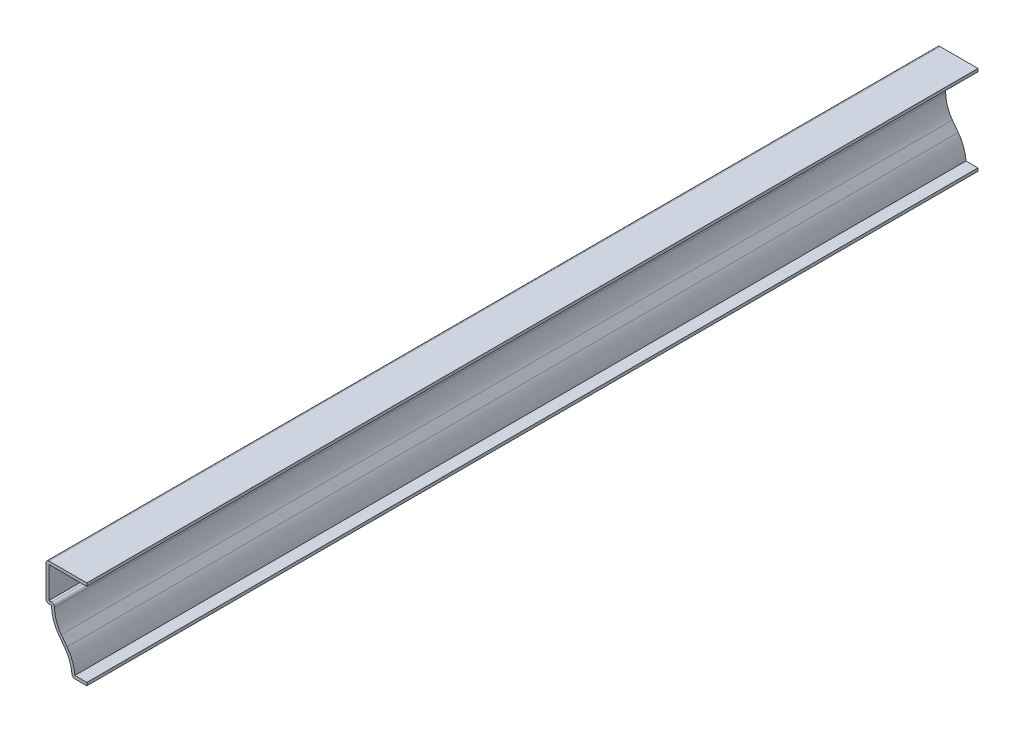
ISO-10303-21;
HEADER;
FILE_DESCRIPTION(('STEP AP214'),'2;1');
FILE_NAME('part.step','',(''),(''),'','','');
FILE_SCHEMA(('AUTOMOTIVE_DESIGN { 1 0 10303 214 1 1 1 1 }'));
ENDSEC;
DATA;
#1=APPLICATION_CONTEXT('core data for automotive mechanical design processes');
#2=APPLICATION_PROTOCOL_DEFINITION('international standard','automotive_design',2000,#1);
#3=PRODUCT_CONTEXT('',#1,'mechanical');
#4=PRODUCT('Part','Part','',(#3));
#5=PRODUCT_RELATED_PRODUCT_CATEGORY('part','',(#4));
#6=PRODUCT_DEFINITION_FORMATION('','',#4);
#7=PRODUCT_DEFINITION_CONTEXT('part definition',#1,'design');
#8=PRODUCT_DEFINITION('design','',#6,#7);
#9=PRODUCT_DEFINITION_SHAPE('','',#8);
#10=(LENGTH_UNIT() NAMED_UNIT(*) SI_UNIT(.MILLI.,.METRE.));
#11=(NAMED_UNIT(*) PLANE_ANGLE_UNIT() SI_UNIT($,.RADIAN.));
#12=(NAMED_UNIT(*) SI_UNIT($,.STERADIAN.) SOLID_ANGLE_UNIT());
#13=UNCERTAINTY_MEASURE_WITH_UNIT(LENGTH_MEASURE(1.E-05),#10,'distance_accuracy_value','');
#14=(GEOMETRIC_REPRESENTATION_CONTEXT(3) GLOBAL_UNCERTAINTY_ASSIGNED_CONTEXT((#13)) GLOBAL_UNIT_ASSIGNED_CONTEXT((#10,
#11,#12)) REPRESENTATION_CONTEXT('',''));
#15=CARTESIAN_POINT('',(0.,0.,0.));
#16=DIRECTION('',(0.,0.,1.));
#17=DIRECTION('',(1.,0.,0.));
#18=AXIS2_PLACEMENT_3D('',#15,#16,#17);
#19=CARTESIAN_POINT('',(-17.4625,36.83,-381.));
#20=DIRECTION('',(0.,-1.,0.));
#21=DIRECTION('',(0.,0.,-1.));
#22=AXIS2_PLACEMENT_3D('',#19,#20,#21);
#23=PLANE('',#22);
#24=DIRECTION('',(1.,0.,0.));
#25=VECTOR('',#24,1.);
#26=CARTESIAN_POINT('',(-17.4625,36.83,0.));
#27=LINE('',#26,#25);
#28=CARTESIAN_POINT('',(-16.1925,36.83,0.));
#29=VERTEX_POINT('',#28);
#30=CARTESIAN_POINT('',(0.,36.83,0.));
#31=VERTEX_POINT('',#30);
#32=EDGE_CURVE('E260',#29,#31,#27,.T.);
#33=ORIENTED_EDGE('',*,*,#32,.F.);
#34=DIRECTION('',(0.,0.,1.));
#35=VECTOR('',#34,1.);
#36=CARTESIAN_POINT('',(-16.1925,36.83,-381.));
#37=LINE('',#36,#35);
#38=CARTESIAN_POINT('',(-16.1925,36.83,-381.));
#39=VERTEX_POINT('',#38);
#40=EDGE_CURVE('E207',#39,#29,#37,.T.);
#41=ORIENTED_EDGE('',*,*,#40,.F.);
#42=DIRECTION('',(1.,0.,0.));
#43=VECTOR('',#42,1.);
#44=CARTESIAN_POINT('',(-17.4625,36.83,-381.));
#45=LINE('',#44,#43);
#46=CARTESIAN_POINT('',(0.,36.83,-381.));
#47=VERTEX_POINT('',#46);
#48=EDGE_CURVE('E186',#39,#47,#45,.T.);
#49=ORIENTED_EDGE('',*,*,#48,.T.);
#50=DIRECTION('',(0.,0.,1.));
#51=VECTOR('',#50,1.);
#52=CARTESIAN_POINT('',(0.,36.83,-381.));
#53=LINE('',#52,#51);
#54=EDGE_CURVE('E196',#47,#31,#53,.T.);
#55=ORIENTED_EDGE('',*,*,#54,.T.);
#56=EDGE_LOOP('',(#33,#41,#49,#55));
#57=FACE_BOUND('',#56,.T.);
#58=ADVANCED_FACE('F41',(#57),#23,.T.);
#59=CARTESIAN_POINT('',(-16.1925,22.225,-381.));
#60=DIRECTION('',(1.,0.,0.));
#61=DIRECTION('',(0.,0.,-1.));
#62=AXIS2_PLACEMENT_3D('',#59,#60,#61);
#63=PLANE('',#62);
#64=DIRECTION('',(0.,1.,0.));
#65=VECTOR('',#64,1.);
#66=CARTESIAN_POINT('',(-16.1925,22.225,0.));
#67=LINE('',#66,#65);
#68=CARTESIAN_POINT('',(-16.1925,23.495,0.));
#69=VERTEX_POINT('',#68);
#70=EDGE_CURVE('E209',#69,#29,#67,.T.);
#71=ORIENTED_EDGE('',*,*,#70,.F.);
#72=DIRECTION('',(0.,0.,1.));
#73=VECTOR('',#72,1.);
#74=CARTESIAN_POINT('',(-16.1925,23.495,-381.));
#75=LINE('',#74,#73);
#76=CARTESIAN_POINT('',(-16.1925,23.495,-381.));
#77=VERTEX_POINT('',#76);
#78=EDGE_CURVE('E312',#77,#69,#75,.T.);
#79=ORIENTED_EDGE('',*,*,#78,.F.);
#80=DIRECTION('',(0.,1.,0.));
#81=VECTOR('',#80,1.);
#82=CARTESIAN_POINT('',(-16.1925,22.225,-381.));
#83=LINE('',#82,#81);
#84=EDGE_CURVE('E205',#77,#39,#83,.T.);
#85=ORIENTED_EDGE('',*,*,#84,.T.);
#86=ORIENTED_EDGE('',*,*,#40,.T.);
#87=EDGE_LOOP('',(#71,#79,#85,#86));
#88=FACE_BOUND('',#87,.T.);
#89=ADVANCED_FACE('F413',(#88),#63,.T.);
#90=CARTESIAN_POINT('',(-15.08125,23.495,-381.));
#91=DIRECTION('',(0.,1.,0.));
#92=DIRECTION('',(0.,0.,1.));
#93=AXIS2_PLACEMENT_3D('',#90,#91,#92);
#94=PLANE('',#93);
#95=DIRECTION('',(1.,0.,0.));
#96=VECTOR('',#95,1.);
#97=CARTESIAN_POINT('',(-15.08125,23.495,0.));
#98=LINE('',#97,#96);
#99=CARTESIAN_POINT('',(-15.08125,23.495,0.));
#100=VERTEX_POINT('',#99);
#101=EDGE_CURVE('E213',#100,#69,#98,.F.);
#102=ORIENTED_EDGE('',*,*,#101,.F.);
#103=DIRECTION('',(0.,0.,1.));
#104=VECTOR('',#103,1.);
#105=CARTESIAN_POINT('',(-15.08125,23.495,-381.));
#106=LINE('',#105,#104);
#107=CARTESIAN_POINT('',(-15.08125,23.495,-381.));
#108=VERTEX_POINT('',#107);
#109=EDGE_CURVE('E11',#100,#108,#106,.F.);
#110=ORIENTED_EDGE('',*,*,#109,.T.);
#111=DIRECTION('',(1.,0.,0.));
#112=VECTOR('',#111,1.);
#113=CARTESIAN_POINT('',(-15.08125,23.495,-381.));
#114=LINE('',#113,#112);
#115=EDGE_CURVE('E255',#108,#77,#114,.F.);
#116=ORIENTED_EDGE('',*,*,#115,.T.);
#117=ORIENTED_EDGE('',*,*,#78,.T.);
#118=EDGE_LOOP('',(#102,#110,#116,#117));
#119=FACE_BOUND('',#118,.T.);
#120=ADVANCED_FACE('F409',(#119),#94,.T.);
#121=CARTESIAN_POINT('',(0.746459168183176,22.225,-381.));
#122=DIRECTION('',(0.,0.,1.));
#123=DIRECTION('',(1.,0.,0.));
#124=AXIS2_PLACEMENT_3D('',#121,#122,#123);
#125=CYLINDRICAL_SURFACE('',#124,14.5577091681832);
#126=CARTESIAN_POINT('',(0.746459168183176,22.225,-381.));
#127=DIRECTION('',(0.,0.,1.));
#128=DIRECTION('',(1.,0.,0.));
#129=AXIS2_PLACEMENT_3D('',#126,#127,#128);
#130=CIRCLE('',#129,14.5577091681832);
#131=CARTESIAN_POINT('',(-10.9398972492268,13.5442183583122,-381.));
#132=VERTEX_POINT('',#131);
#133=CARTESIAN_POINT('',(-13.81125,22.225,-381.));
#134=VERTEX_POINT('',#133);
#135=EDGE_CURVE('E251',#132,#134,#130,.F.);
#136=ORIENTED_EDGE('',*,*,#135,.T.);
#137=DIRECTION('',(0.,0.,1.));
#138=VECTOR('',#137,1.);
#139=CARTESIAN_POINT('',(-13.81125,22.225,-381.));
#140=LINE('',#139,#138);
#141=CARTESIAN_POINT('',(-13.81125,22.225,0.));
#142=VERTEX_POINT('',#141);
#143=EDGE_CURVE('E50',#134,#142,#140,.T.);
#144=ORIENTED_EDGE('',*,*,#143,.T.);
#145=CARTESIAN_POINT('',(0.746459168183176,22.225,0.));
#146=DIRECTION('',(0.,0.,1.));
#147=DIRECTION('',(1.,0.,0.));
#148=AXIS2_PLACEMENT_3D('',#145,#146,#147);
#149=CIRCLE('',#148,14.5577091681832);
#150=CARTESIAN_POINT('',(-10.9398972492268,13.5442183583122,0.));
#151=VERTEX_POINT('',#150);
#152=EDGE_CURVE('E303',#151,#142,#149,.F.);
#153=ORIENTED_EDGE('',*,*,#152,.F.);
#154=DIRECTION('',(0.,0.,1.));
#155=VECTOR('',#154,1.);
#156=CARTESIAN_POINT('',(-10.9398972492268,13.5442183583122,-381.));
#157=LINE('',#156,#155);
#158=EDGE_CURVE('E316',#132,#151,#157,.T.);
#159=ORIENTED_EDGE('',*,*,#158,.F.);
#160=EDGE_LOOP('',(#136,#144,#153,#159));
#161=FACE_BOUND('',#160,.T.);
#162=ADVANCED_FACE('F392',(#161),#125,.F.);
#163=CARTESIAN_POINT('',(-10.9398972492268,13.5442183583122,-381.));
#164=DIRECTION('',(0.802760673564718,0.596301350810075,0.));
#165=DIRECTION('',(-0.596301350810075,0.802760673564718,0.));
#166=AXIS2_PLACEMENT_3D('',#163,#164,#165);
#167=PLANE('',#166);
#168=DIRECTION('',(-0.596301350810075,0.802760673564718,0.));
#169=VECTOR('',#168,1.);
#170=CARTESIAN_POINT('',(-10.9398972492268,13.5442183583122,0.));
#171=LINE('',#170,#169);
#172=CARTESIAN_POINT('',(-8.45234063991878,10.1953870727454,0.));
#173=VERTEX_POINT('',#172);
#174=EDGE_CURVE('E299',#173,#151,#171,.T.);
#175=ORIENTED_EDGE('',*,*,#174,.F.);
#176=DIRECTION('',(0.,0.,1.));
#177=VECTOR('',#176,1.);
#178=CARTESIAN_POINT('',(-8.45234063991878,10.1953870727454,-381.));
#179=LINE('',#178,#177);
#180=CARTESIAN_POINT('',(-8.45234063991878,10.1953870727454,-381.));
#181=VERTEX_POINT('',#180);
#182=EDGE_CURVE('E319',#181,#173,#179,.T.);
#183=ORIENTED_EDGE('',*,*,#182,.F.);
#184=DIRECTION('',(-0.596301350810075,0.802760673564718,0.));
#185=VECTOR('',#184,1.);
#186=CARTESIAN_POINT('',(-10.9398972492268,13.5442183583122,-381.));
#187=LINE('',#186,#185);
#188=EDGE_CURVE('E247',#181,#132,#187,.T.);
#189=ORIENTED_EDGE('',*,*,#188,.T.);
#190=ORIENTED_EDGE('',*,*,#158,.T.);
#191=EDGE_LOOP('',(#175,#183,#189,#190));
#192=FACE_BOUND('',#191,.T.);
#193=ADVANCED_FACE('F403',(#192),#167,.T.);
#194=CARTESIAN_POINT('',(-22.1777091681832,0.,-381.));
#195=DIRECTION('',(0.,0.,1.));
#196=DIRECTION('',(1.,0.,0.));
#197=AXIS2_PLACEMENT_3D('',#194,#195,#196);
#198=CYLINDRICAL_SURFACE('',#197,17.0977091681832);
#199=CARTESIAN_POINT('',(-22.1777091681832,0.,0.));
#200=DIRECTION('',(0.,0.,1.));
#201=DIRECTION('',(1.,0.,0.));
#202=AXIS2_PLACEMENT_3D('',#199,#200,#201);
#203=CIRCLE('',#202,17.0977091681832);
#204=CARTESIAN_POINT('',(-5.12723237720237,1.27,0.));
#205=VERTEX_POINT('',#204);
#206=EDGE_CURVE('E295',#205,#173,#203,.T.);
#207=ORIENTED_EDGE('',*,*,#206,.F.);
#208=DIRECTION('',(0.,0.,1.));
#209=VECTOR('',#208,1.);
#210=CARTESIAN_POINT('',(-5.12723237720237,1.27,-381.));
#211=LINE('',#210,#209);
#212=CARTESIAN_POINT('',(-5.12723237720237,1.27,-381.));
#213=VERTEX_POINT('',#212);
#214=EDGE_CURVE('E322',#213,#205,#211,.T.);
#215=ORIENTED_EDGE('',*,*,#214,.F.);
#216=CARTESIAN_POINT('',(-22.1777091681832,0.,-381.));
#217=DIRECTION('',(0.,0.,1.));
#218=DIRECTION('',(1.,0.,0.));
#219=AXIS2_PLACEMENT_3D('',#216,#217,#218);
#220=CIRCLE('',#219,17.0977091681832);
#221=EDGE_CURVE('E243',#213,#181,#220,.T.);
#222=ORIENTED_EDGE('',*,*,#221,.T.);
#223=ORIENTED_EDGE('',*,*,#182,.T.);
#224=EDGE_LOOP('',(#207,#215,#222,#223));
#225=FACE_BOUND('',#224,.T.);
#226=ADVANCED_FACE('F429',(#225),#198,.T.);
#227=CARTESIAN_POINT('',(0.,1.27,-381.));
#228=DIRECTION('',(0.,1.,0.));
#229=DIRECTION('',(-1.,0.,0.));
#230=AXIS2_PLACEMENT_3D('',#227,#228,#229);
#231=PLANE('',#230);
#232=DIRECTION('',(-1.,0.,0.));
#233=VECTOR('',#232,1.);
#234=CARTESIAN_POINT('',(0.,1.27,0.));
#235=LINE('',#234,#233);
#236=CARTESIAN_POINT('',(0.,1.27,0.));
#237=VERTEX_POINT('',#236);
#238=EDGE_CURVE('E291',#237,#205,#235,.T.);
#239=ORIENTED_EDGE('',*,*,#238,.F.);
#240=DIRECTION('',(0.,0.,1.));
#241=VECTOR('',#240,1.);
#242=CARTESIAN_POINT('',(0.,1.27,-381.));
#243=LINE('',#242,#241);
#244=CARTESIAN_POINT('',(0.,1.27,-381.));
#245=VERTEX_POINT('',#244);
#246=EDGE_CURVE('E325',#245,#237,#243,.T.);
#247=ORIENTED_EDGE('',*,*,#246,.F.);
#248=DIRECTION('',(-1.,0.,0.));
#249=VECTOR('',#248,1.);
#250=CARTESIAN_POINT('',(0.,1.27,-381.));
#251=LINE('',#250,#249);
#252=EDGE_CURVE('E239',#245,#213,#251,.T.);
#253=ORIENTED_EDGE('',*,*,#252,.T.);
#254=ORIENTED_EDGE('',*,*,#214,.T.);
#255=EDGE_LOOP('',(#239,#247,#253,#254));
#256=FACE_BOUND('',#255,.T.);
#257=ADVANCED_FACE('F432',(#256),#231,.T.);
#258=CARTESIAN_POINT('',(0.,1.27,-381.));
#259=DIRECTION('',(-1.,0.,0.));
#260=DIRECTION('',(0.,-1.,0.));
#261=AXIS2_PLACEMENT_3D('',#258,#259,#260);
#262=PLANE('',#261);
#263=DIRECTION('',(0.,-1.,0.));
#264=VECTOR('',#263,1.);
#265=CARTESIAN_POINT('',(0.,1.27,0.));
#266=LINE('',#265,#264);
#267=CARTESIAN_POINT('',(0.,0.,0.));
#268=VERTEX_POINT('',#267);
#269=EDGE_CURVE('E288',#237,#268,#266,.T.);
#270=ORIENTED_EDGE('',*,*,#269,.T.);
#271=DIRECTION('',(0.,0.,1.));
#272=VECTOR('',#271,1.);
#273=CARTESIAN_POINT('',(0.,0.,-381.));
#274=LINE('',#273,#272);
#275=CARTESIAN_POINT('',(0.,0.,-381.));
#276=VERTEX_POINT('',#275);
#277=EDGE_CURVE('E328',#276,#268,#274,.T.);
#278=ORIENTED_EDGE('',*,*,#277,.F.);
#279=DIRECTION('',(0.,-1.,0.));
#280=VECTOR('',#279,1.);
#281=CARTESIAN_POINT('',(0.,1.27,-381.));
#282=LINE('',#281,#280);
#283=EDGE_CURVE('E236',#245,#276,#282,.T.);
#284=ORIENTED_EDGE('',*,*,#283,.F.);
#285=ORIENTED_EDGE('',*,*,#246,.T.);
#286=EDGE_LOOP('',(#270,#278,#284,#285));
#287=FACE_BOUND('',#286,.T.);
#288=ADVANCED_FACE('F436',(#287),#262,.F.);
#289=CARTESIAN_POINT('',(0.,0.,-381.));
#290=DIRECTION('',(0.,1.,0.));
#291=DIRECTION('',(-1.,0.,0.));
#292=AXIS2_PLACEMENT_3D('',#289,#290,#291);
#293=PLANE('',#292);
#294=DIRECTION('',(-1.,0.,0.));
#295=VECTOR('',#294,1.);
#296=CARTESIAN_POINT('',(0.,0.,0.));
#297=LINE('',#296,#295);
#298=CARTESIAN_POINT('',(-5.12723237720237,0.,0.));
#299=VERTEX_POINT('',#298);
#300=EDGE_CURVE('E284',#268,#299,#297,.T.);
#301=ORIENTED_EDGE('',*,*,#300,.T.);
#302=DIRECTION('',(0.,0.,1.));
#303=VECTOR('',#302,1.);
#304=CARTESIAN_POINT('',(-5.12723237720237,0.,-381.));
#305=LINE('',#304,#303);
#306=CARTESIAN_POINT('',(-5.12723237720237,0.,-381.));
#307=VERTEX_POINT('',#306);
#308=EDGE_CURVE('E385',#299,#307,#305,.F.);
#309=ORIENTED_EDGE('',*,*,#308,.T.);
#310=DIRECTION('',(-1.,0.,0.));
#311=VECTOR('',#310,1.);
#312=CARTESIAN_POINT('',(0.,0.,-381.));
#313=LINE('',#312,#311);
#314=EDGE_CURVE('E233',#276,#307,#313,.T.);
#315=ORIENTED_EDGE('',*,*,#314,.F.);
#316=ORIENTED_EDGE('',*,*,#277,.T.);
#317=EDGE_LOOP('',(#301,#309,#315,#316));
#318=FACE_BOUND('',#317,.T.);
#319=ADVANCED_FACE('F440',(#318),#293,.F.);
#320=CARTESIAN_POINT('',(-22.1777091681832,0.,-381.));
#321=DIRECTION('',(0.,0.,1.));
#322=DIRECTION('',(1.,0.,0.));
#323=AXIS2_PLACEMENT_3D('',#320,#321,#322);
#324=CYLINDRICAL_SURFACE('',#323,15.8277091681832);
#325=CARTESIAN_POINT('',(-22.1777091681832,0.,-381.));
#326=DIRECTION('',(0.,0.,1.));
#327=DIRECTION('',(1.,0.,0.));
#328=AXIS2_PLACEMENT_3D('',#325,#326,#327);
#329=CIRCLE('',#328,15.8277091681832);
#330=CARTESIAN_POINT('',(-6.39372400549848,1.17566572491469,-381.));
#331=VERTEX_POINT('',#330);
#332=CARTESIAN_POINT('',(-9.47184669534598,9.43808435721663,-381.));
#333=VERTEX_POINT('',#332);
#334=EDGE_CURVE('E230',#331,#333,#329,.T.);
#335=ORIENTED_EDGE('',*,*,#334,.F.);
#336=DIRECTION('',(0.,0.,1.));
#337=VECTOR('',#336,1.);
#338=CARTESIAN_POINT('',(-6.39372400549848,1.17566572491469,-381.));
#339=LINE('',#338,#337);
#340=CARTESIAN_POINT('',(-6.39372400549848,1.17566572491469,0.));
#341=VERTEX_POINT('',#340);
#342=EDGE_CURVE('E381',#331,#341,#339,.T.);
#343=ORIENTED_EDGE('',*,*,#342,.T.);
#344=CARTESIAN_POINT('',(-22.1777091681832,0.,0.));
#345=DIRECTION('',(0.,0.,1.));
#346=DIRECTION('',(1.,0.,0.));
#347=AXIS2_PLACEMENT_3D('',#344,#345,#346);
#348=CIRCLE('',#347,15.8277091681832);
#349=CARTESIAN_POINT('',(-9.47184669534598,9.43808435721663,0.));
#350=VERTEX_POINT('',#349);
#351=EDGE_CURVE('E281',#341,#350,#348,.T.);
#352=ORIENTED_EDGE('',*,*,#351,.T.);
#353=DIRECTION('',(0.,0.,1.));
#354=VECTOR('',#353,1.);
#355=CARTESIAN_POINT('',(-9.47184669534598,9.43808435721663,-381.));
#356=LINE('',#355,#354);
#357=EDGE_CURVE('E332',#333,#350,#356,.T.);
#358=ORIENTED_EDGE('',*,*,#357,.F.);
#359=EDGE_LOOP('',(#335,#343,#352,#358));
#360=FACE_BOUND('',#359,.T.);
#361=ADVANCED_FACE('F444',(#360),#324,.F.);
#362=CARTESIAN_POINT('',(-11.959403304654,12.7869156427834,-381.));
#363=DIRECTION('',(0.802760673564718,0.596301350810075,0.));
#364=DIRECTION('',(-0.596301350810075,0.802760673564718,0.));
#365=AXIS2_PLACEMENT_3D('',#362,#363,#364);
#366=PLANE('',#365);
#367=DIRECTION('',(-0.596301350810075,0.802760673564718,0.));
#368=VECTOR('',#367,1.);
#369=CARTESIAN_POINT('',(-11.959403304654,12.7869156427834,0.));
#370=LINE('',#369,#368);
#371=CARTESIAN_POINT('',(-11.959403304654,12.7869156427834,0.));
#372=VERTEX_POINT('',#371);
#373=EDGE_CURVE('E278',#350,#372,#370,.T.);
#374=ORIENTED_EDGE('',*,*,#373,.T.);
#375=DIRECTION('',(0.,0.,1.));
#376=VECTOR('',#375,1.);
#377=CARTESIAN_POINT('',(-11.959403304654,12.7869156427834,-381.));
#378=LINE('',#377,#376);
#379=CARTESIAN_POINT('',(-11.959403304654,12.7869156427834,-381.));
#380=VERTEX_POINT('',#379);
#381=EDGE_CURVE('E336',#380,#372,#378,.T.);
#382=ORIENTED_EDGE('',*,*,#381,.F.);
#383=DIRECTION('',(-0.596301350810075,0.802760673564718,0.));
#384=VECTOR('',#383,1.);
#385=CARTESIAN_POINT('',(-11.959403304654,12.7869156427834,-381.));
#386=LINE('',#385,#384);
#387=EDGE_CURVE('E227',#333,#380,#386,.T.);
#388=ORIENTED_EDGE('',*,*,#387,.F.);
#389=ORIENTED_EDGE('',*,*,#357,.T.);
#390=EDGE_LOOP('',(#374,#382,#388,#389));
#391=FACE_BOUND('',#390,.T.);
#392=ADVANCED_FACE('F448',(#391),#366,.F.);
#393=CARTESIAN_POINT('',(0.746459168183176,22.225,-381.));
#394=DIRECTION('',(0.,0.,1.));
#395=DIRECTION('',(1.,0.,0.));
#396=AXIS2_PLACEMENT_3D('',#393,#394,#395);
#397=CYLINDRICAL_SURFACE('',#396,15.8277091681832);
#398=CARTESIAN_POINT('',(0.746459168183176,22.225,0.));
#399=DIRECTION('',(0.,0.,-1.));
#400=DIRECTION('',(1.,0.,0.));
#401=AXIS2_PLACEMENT_3D('',#398,#399,#400);
#402=CIRCLE('',#401,15.8277091681832);
#403=CARTESIAN_POINT('',(-15.08125,22.225,0.));
#404=VERTEX_POINT('',#403);
#405=EDGE_CURVE('E275',#372,#404,#402,.T.);
#406=ORIENTED_EDGE('',*,*,#405,.T.);
#407=DIRECTION('',(0.,0.,1.));
#408=VECTOR('',#407,1.);
#409=CARTESIAN_POINT('',(-15.08125,22.225,-381.));
#410=LINE('',#409,#408);
#411=CARTESIAN_POINT('',(-15.08125,22.225,-381.));
#412=VERTEX_POINT('',#411);
#413=EDGE_CURVE('E340',#412,#404,#410,.T.);
#414=ORIENTED_EDGE('',*,*,#413,.F.);
#415=CARTESIAN_POINT('',(0.746459168183176,22.225,-381.));
#416=DIRECTION('',(0.,0.,-1.));
#417=DIRECTION('',(1.,0.,0.));
#418=AXIS2_PLACEMENT_3D('',#415,#416,#417);
#419=CIRCLE('',#418,15.8277091681832);
#420=EDGE_CURVE('E224',#380,#412,#419,.T.);
#421=ORIENTED_EDGE('',*,*,#420,.F.);
#422=ORIENTED_EDGE('',*,*,#381,.T.);
#423=EDGE_LOOP('',(#406,#414,#421,#422));
#424=FACE_BOUND('',#423,.T.);
#425=ADVANCED_FACE('F452',(#424),#397,.T.);
#426=CARTESIAN_POINT('',(-15.08125,22.225,-381.));
#427=DIRECTION('',(0.,1.,0.));
#428=DIRECTION('',(0.,0.,1.));
#429=AXIS2_PLACEMENT_3D('',#426,#427,#428);
#430=PLANE('',#429);
#431=DIRECTION('',(-1.,0.,0.));
#432=VECTOR('',#431,1.);
#433=CARTESIAN_POINT('',(-15.08125,22.225,0.));
#434=LINE('',#433,#432);
#435=CARTESIAN_POINT('',(-16.1925,22.225,0.));
#436=VERTEX_POINT('',#435);
#437=EDGE_CURVE('E272',#404,#436,#434,.T.);
#438=ORIENTED_EDGE('',*,*,#437,.T.);
#439=DIRECTION('',(0.,0.,1.));
#440=VECTOR('',#439,1.);
#441=CARTESIAN_POINT('',(-16.1925,22.225,-381.));
#442=LINE('',#441,#440);
#443=CARTESIAN_POINT('',(-16.1925,22.225,-381.));
#444=VERTEX_POINT('',#443);
#445=EDGE_CURVE('E57',#436,#444,#442,.F.);
#446=ORIENTED_EDGE('',*,*,#445,.T.);
#447=DIRECTION('',(-1.,0.,0.));
#448=VECTOR('',#447,1.);
#449=CARTESIAN_POINT('',(-15.08125,22.225,-381.));
#450=LINE('',#449,#448);
#451=EDGE_CURVE('E221',#412,#444,#450,.T.);
#452=ORIENTED_EDGE('',*,*,#451,.F.);
#453=ORIENTED_EDGE('',*,*,#413,.T.);
#454=EDGE_LOOP('',(#438,#446,#452,#453));
#455=FACE_BOUND('',#454,.T.);
#456=ADVANCED_FACE('F456',(#455),#430,.F.);
#457=CARTESIAN_POINT('',(-17.4625,22.225,-381.));
#458=DIRECTION('',(1.,0.,0.));
#459=DIRECTION('',(0.,0.,-1.));
#460=AXIS2_PLACEMENT_3D('',#457,#458,#459);
#461=PLANE('',#460);
#462=DIRECTION('',(0.,1.,0.));
#463=VECTOR('',#462,1.);
#464=CARTESIAN_POINT('',(-17.4625,22.225,0.));
#465=LINE('',#464,#463);
#466=CARTESIAN_POINT('',(-17.4625,23.495,0.));
#467=VERTEX_POINT('',#466);
#468=CARTESIAN_POINT('',(-17.4625,36.83,0.));
#469=VERTEX_POINT('',#468);
#470=EDGE_CURVE('E268',#467,#469,#465,.T.);
#471=ORIENTED_EDGE('',*,*,#470,.T.);
#472=DIRECTION('',(0.,0.,1.));
#473=VECTOR('',#472,1.);
#474=CARTESIAN_POINT('',(-17.4625,36.83,-381.));
#475=LINE('',#474,#473);
#476=CARTESIAN_POINT('',(-17.4625,36.83,-381.));
#477=VERTEX_POINT('',#476);
#478=EDGE_CURVE('E365',#469,#477,#475,.F.);
#479=ORIENTED_EDGE('',*,*,#478,.T.);
#480=DIRECTION('',(0.,1.,0.));
#481=VECTOR('',#480,1.);
#482=CARTESIAN_POINT('',(-17.4625,22.225,-381.));
#483=LINE('',#482,#481);
#484=CARTESIAN_POINT('',(-17.4625,23.495,-381.));
#485=VERTEX_POINT('',#484);
#486=EDGE_CURVE('E218',#485,#477,#483,.T.);
#487=ORIENTED_EDGE('',*,*,#486,.F.);
#488=DIRECTION('',(0.,0.,1.));
#489=VECTOR('',#488,1.);
#490=CARTESIAN_POINT('',(-17.4625,23.495,-381.));
#491=LINE('',#490,#489);
#492=EDGE_CURVE('E361',#485,#467,#491,.T.);
#493=ORIENTED_EDGE('',*,*,#492,.T.);
#494=EDGE_LOOP('',(#471,#479,#487,#493));
#495=FACE_BOUND('',#494,.T.);
#496=ADVANCED_FACE('F460',(#495),#461,.F.);
#497=CARTESIAN_POINT('',(-17.4625,38.1,-381.));
#498=DIRECTION('',(0.,-1.,0.));
#499=DIRECTION('',(0.,0.,-1.));
#500=AXIS2_PLACEMENT_3D('',#497,#498,#499);
#501=PLANE('',#500);
#502=DIRECTION('',(1.,0.,0.));
#503=VECTOR('',#502,1.);
#504=CARTESIAN_POINT('',(-17.4625,38.1,-381.));
#505=LINE('',#504,#503);
#506=CARTESIAN_POINT('',(-16.1925,38.1,-381.));
#507=VERTEX_POINT('',#506);
#508=CARTESIAN_POINT('',(0.,38.1,-381.));
#509=VERTEX_POINT('',#508);
#510=EDGE_CURVE('E189',#507,#509,#505,.T.);
#511=ORIENTED_EDGE('',*,*,#510,.F.);
#512=DIRECTION('',(0.,0.,1.));
#513=VECTOR('',#512,1.);
#514=CARTESIAN_POINT('',(-16.1925,38.1,-381.));
#515=LINE('',#514,#513);
#516=CARTESIAN_POINT('',(-16.1925,38.1,0.));
#517=VERTEX_POINT('',#516);
#518=EDGE_CURVE('E311',#507,#517,#515,.T.);
#519=ORIENTED_EDGE('',*,*,#518,.T.);
#520=DIRECTION('',(1.,0.,0.));
#521=VECTOR('',#520,1.);
#522=CARTESIAN_POINT('',(-17.4625,38.1,0.));
#523=LINE('',#522,#521);
#524=CARTESIAN_POINT('',(0.,38.1,0.));
#525=VERTEX_POINT('',#524);
#526=EDGE_CURVE('E265',#517,#525,#523,.T.);
#527=ORIENTED_EDGE('',*,*,#526,.T.);
#528=DIRECTION('',(0.,0.,1.));
#529=VECTOR('',#528,1.);
#530=CARTESIAN_POINT('',(0.,38.1,-381.));
#531=LINE('',#530,#529);
#532=EDGE_CURVE('E204',#509,#525,#531,.T.);
#533=ORIENTED_EDGE('',*,*,#532,.F.);
#534=EDGE_LOOP('',(#511,#519,#527,#533));
#535=FACE_BOUND('',#534,.T.);
#536=ADVANCED_FACE('F463',(#535),#501,.F.);
#537=CARTESIAN_POINT('',(0.,38.1,-381.));
#538=DIRECTION('',(-1.,0.,0.));
#539=DIRECTION('',(0.,0.,1.));
#540=AXIS2_PLACEMENT_3D('',#537,#538,#539);
#541=PLANE('',#540);
#542=DIRECTION('',(0.,-1.,0.));
#543=VECTOR('',#542,1.);
#544=CARTESIAN_POINT('',(0.,38.1,0.));
#545=LINE('',#544,#543);
#546=EDGE_CURVE('E199',#525,#31,#545,.T.);
#547=ORIENTED_EDGE('',*,*,#546,.T.);
#548=ORIENTED_EDGE('',*,*,#54,.F.);
#549=DIRECTION('',(0.,-1.,0.));
#550=VECTOR('',#549,1.);
#551=CARTESIAN_POINT('',(0.,38.1,-381.));
#552=LINE('',#551,#550);
#553=EDGE_CURVE('E180',#509,#47,#552,.T.);
#554=ORIENTED_EDGE('',*,*,#553,.F.);
#555=ORIENTED_EDGE('',*,*,#532,.T.);
#556=EDGE_LOOP('',(#547,#548,#554,#555));
#557=FACE_BOUND('',#556,.T.);
#558=ADVANCED_FACE('F197',(#557),#541,.F.);
#559=CARTESIAN_POINT('',(0.746459168183176,22.225,-381.));
#560=DIRECTION('',(0.,0.,-1.));
#561=DIRECTION('',(-1.,0.,0.));
#562=AXIS2_PLACEMENT_3D('',#559,#560,#561);
#563=PLANE('',#562);
#564=ORIENTED_EDGE('',*,*,#486,.T.);
#565=CARTESIAN_POINT('',(-16.1925,36.83,-381.));
#566=DIRECTION('',(0.,0.,-1.));
#567=DIRECTION('',(-1.,0.,0.));
#568=AXIS2_PLACEMENT_3D('',#565,#566,#567);
#569=CIRCLE('',#568,1.27);
#570=EDGE_CURVE('E376',#477,#507,#569,.T.);
#571=ORIENTED_EDGE('',*,*,#570,.T.);
#572=ORIENTED_EDGE('',*,*,#510,.T.);
#573=ORIENTED_EDGE('',*,*,#553,.T.);
#574=ORIENTED_EDGE('',*,*,#48,.F.);
#575=ORIENTED_EDGE('',*,*,#84,.F.);
#576=ORIENTED_EDGE('',*,*,#115,.F.);
#577=CARTESIAN_POINT('',(-15.08125,22.225,-381.));
#578=DIRECTION('',(0.,0.,-1.));
#579=DIRECTION('',(-1.,0.,0.));
#580=AXIS2_PLACEMENT_3D('',#577,#578,#579);
#581=CIRCLE('',#580,1.27);
#582=EDGE_CURVE('E368',#108,#134,#581,.T.);
#583=ORIENTED_EDGE('',*,*,#582,.T.);
#584=ORIENTED_EDGE('',*,*,#135,.F.);
#585=ORIENTED_EDGE('',*,*,#188,.F.);
#586=ORIENTED_EDGE('',*,*,#221,.F.);
#587=ORIENTED_EDGE('',*,*,#252,.F.);
#588=ORIENTED_EDGE('',*,*,#283,.T.);
#589=ORIENTED_EDGE('',*,*,#314,.T.);
#590=CARTESIAN_POINT('',(-5.12723237720237,1.27,-381.));
#591=DIRECTION('',(0.,0.,-1.));
#592=DIRECTION('',(-1.,0.,0.));
#593=AXIS2_PLACEMENT_3D('',#590,#591,#592);
#594=CIRCLE('',#593,1.27);
#595=EDGE_CURVE('E65',#307,#331,#594,.T.);
#596=ORIENTED_EDGE('',*,*,#595,.T.);
#597=ORIENTED_EDGE('',*,*,#334,.T.);
#598=ORIENTED_EDGE('',*,*,#387,.T.);
#599=ORIENTED_EDGE('',*,*,#420,.T.);
#600=ORIENTED_EDGE('',*,*,#451,.T.);
#601=CARTESIAN_POINT('',(-16.1925,23.495,-381.));
#602=DIRECTION('',(0.,0.,-1.));
#603=DIRECTION('',(-1.,0.,0.));
#604=AXIS2_PLACEMENT_3D('',#601,#602,#603);
#605=CIRCLE('',#604,1.27);
#606=EDGE_CURVE('E373',#444,#485,#605,.T.);
#607=ORIENTED_EDGE('',*,*,#606,.T.);
#608=EDGE_LOOP('',(#564,#571,#572,#573,#574,#575,#576,#583,#584,#585,#586,#587,#588,#589,#596,
#597,#598,#599,#600,#607));
#609=FACE_BOUND('',#608,.T.);
#610=ADVANCED_FACE('F183',(#609),#563,.T.);
#611=CARTESIAN_POINT('',(0.746459168183176,22.225,0.));
#612=DIRECTION('',(0.,0.,-1.));
#613=DIRECTION('',(-1.,0.,0.));
#614=AXIS2_PLACEMENT_3D('',#611,#612,#613);
#615=PLANE('',#614);
#616=ORIENTED_EDGE('',*,*,#526,.F.);
#617=CARTESIAN_POINT('',(-16.1925,36.83,0.));
#618=DIRECTION('',(0.,0.,-1.));
#619=DIRECTION('',(-1.,0.,0.));
#620=AXIS2_PLACEMENT_3D('',#617,#618,#619);
#621=CIRCLE('',#620,1.27);
#622=EDGE_CURVE('E358',#517,#469,#621,.F.);
#623=ORIENTED_EDGE('',*,*,#622,.T.);
#624=ORIENTED_EDGE('',*,*,#470,.F.);
#625=CARTESIAN_POINT('',(-16.1925,23.495,0.));
#626=DIRECTION('',(0.,0.,-1.));
#627=DIRECTION('',(-1.,0.,0.));
#628=AXIS2_PLACEMENT_3D('',#625,#626,#627);
#629=CIRCLE('',#628,1.27);
#630=EDGE_CURVE('E355',#467,#436,#629,.F.);
#631=ORIENTED_EDGE('',*,*,#630,.T.);
#632=ORIENTED_EDGE('',*,*,#437,.F.);
#633=ORIENTED_EDGE('',*,*,#405,.F.);
#634=ORIENTED_EDGE('',*,*,#373,.F.);
#635=ORIENTED_EDGE('',*,*,#351,.F.);
#636=CARTESIAN_POINT('',(-5.12723237720237,1.27,0.));
#637=DIRECTION('',(0.,0.,-1.));
#638=DIRECTION('',(-1.,0.,0.));
#639=AXIS2_PLACEMENT_3D('',#636,#637,#638);
#640=CIRCLE('',#639,1.27);
#641=EDGE_CURVE('E352',#341,#299,#640,.F.);
#642=ORIENTED_EDGE('',*,*,#641,.T.);
#643=ORIENTED_EDGE('',*,*,#300,.F.);
#644=ORIENTED_EDGE('',*,*,#269,.F.);
#645=ORIENTED_EDGE('',*,*,#238,.T.);
#646=ORIENTED_EDGE('',*,*,#206,.T.);
#647=ORIENTED_EDGE('',*,*,#174,.T.);
#648=ORIENTED_EDGE('',*,*,#152,.T.);
#649=CARTESIAN_POINT('',(-15.08125,22.225,0.));
#650=DIRECTION('',(0.,0.,-1.));
#651=DIRECTION('',(-1.,0.,0.));
#652=AXIS2_PLACEMENT_3D('',#649,#650,#651);
#653=CIRCLE('',#652,1.27);
#654=EDGE_CURVE('E349',#142,#100,#653,.F.);
#655=ORIENTED_EDGE('',*,*,#654,.T.);
#656=ORIENTED_EDGE('',*,*,#101,.T.);
#657=ORIENTED_EDGE('',*,*,#70,.T.);
#658=ORIENTED_EDGE('',*,*,#32,.T.);
#659=ORIENTED_EDGE('',*,*,#546,.F.);
#660=EDGE_LOOP('',(#616,#623,#624,#631,#632,#633,#634,#635,#642,#643,#644,#645,#646,#647,#648,
#655,#656,#657,#658,#659));
#661=FACE_BOUND('',#660,.T.);
#662=ADVANCED_FACE('F398',(#661),#615,.F.);
#663=CARTESIAN_POINT('',(-16.1925,36.83,-381.));
#664=DIRECTION('',(0.,0.,1.));
#665=DIRECTION('',(1.,0.,0.));
#666=AXIS2_PLACEMENT_3D('',#663,#664,#665);
#667=CYLINDRICAL_SURFACE('',#666,1.27);
#668=ORIENTED_EDGE('',*,*,#570,.F.);
#669=ORIENTED_EDGE('',*,*,#478,.F.);
#670=ORIENTED_EDGE('',*,*,#622,.F.);
#671=ORIENTED_EDGE('',*,*,#518,.F.);
#672=EDGE_LOOP('',(#668,#669,#670,#671));
#673=FACE_BOUND('',#672,.T.);
#674=ADVANCED_FACE('F470',(#673),#667,.T.);
#675=CARTESIAN_POINT('',(-16.1925,23.495,-381.));
#676=DIRECTION('',(0.,0.,1.));
#677=DIRECTION('',(1.,0.,0.));
#678=AXIS2_PLACEMENT_3D('',#675,#676,#677);
#679=CYLINDRICAL_SURFACE('',#678,1.27);
#680=ORIENTED_EDGE('',*,*,#606,.F.);
#681=ORIENTED_EDGE('',*,*,#445,.F.);
#682=ORIENTED_EDGE('',*,*,#630,.F.);
#683=ORIENTED_EDGE('',*,*,#492,.F.);
#684=EDGE_LOOP('',(#680,#681,#682,#683));
#685=FACE_BOUND('',#684,.T.);
#686=ADVANCED_FACE('F473',(#685),#679,.T.);
#687=CARTESIAN_POINT('',(-5.12723237720237,1.27,-381.));
#688=DIRECTION('',(0.,0.,1.));
#689=DIRECTION('',(1.,0.,0.));
#690=AXIS2_PLACEMENT_3D('',#687,#688,#689);
#691=CYLINDRICAL_SURFACE('',#690,1.27);
#692=ORIENTED_EDGE('',*,*,#595,.F.);
#693=ORIENTED_EDGE('',*,*,#308,.F.);
#694=ORIENTED_EDGE('',*,*,#641,.F.);
#695=ORIENTED_EDGE('',*,*,#342,.F.);
#696=EDGE_LOOP('',(#692,#693,#694,#695));
#697=FACE_BOUND('',#696,.T.);
#698=ADVANCED_FACE('F476',(#697),#691,.T.);
#699=CARTESIAN_POINT('',(-15.08125,22.225,-381.));
#700=DIRECTION('',(0.,0.,1.));
#701=DIRECTION('',(1.,0.,0.));
#702=AXIS2_PLACEMENT_3D('',#699,#700,#701);
#703=CYLINDRICAL_SURFACE('',#702,1.27);
#704=ORIENTED_EDGE('',*,*,#582,.F.);
#705=ORIENTED_EDGE('',*,*,#109,.F.);
#706=ORIENTED_EDGE('',*,*,#654,.F.);
#707=ORIENTED_EDGE('',*,*,#143,.F.);
#708=EDGE_LOOP('',(#704,#705,#706,#707));
#709=FACE_BOUND('',#708,.T.);
#710=ADVANCED_FACE('F43',(#709),#703,.T.);
#711=CLOSED_SHELL('',(#58,#89,#120,#162,#193,#226,#257,#288,#319,#361,#392,#425,#456,#496,#536,
#558,#610,#662,#674,#686,#698,#710));
#712=MANIFOLD_SOLID_BREP('B2',#711);
#713=ADVANCED_BREP_SHAPE_REPRESENTATION('',(#18,#712),#14);
#714=SHAPE_DEFINITION_REPRESENTATION(#9,#713);
ENDSEC;
END-ISO-10303-21;
